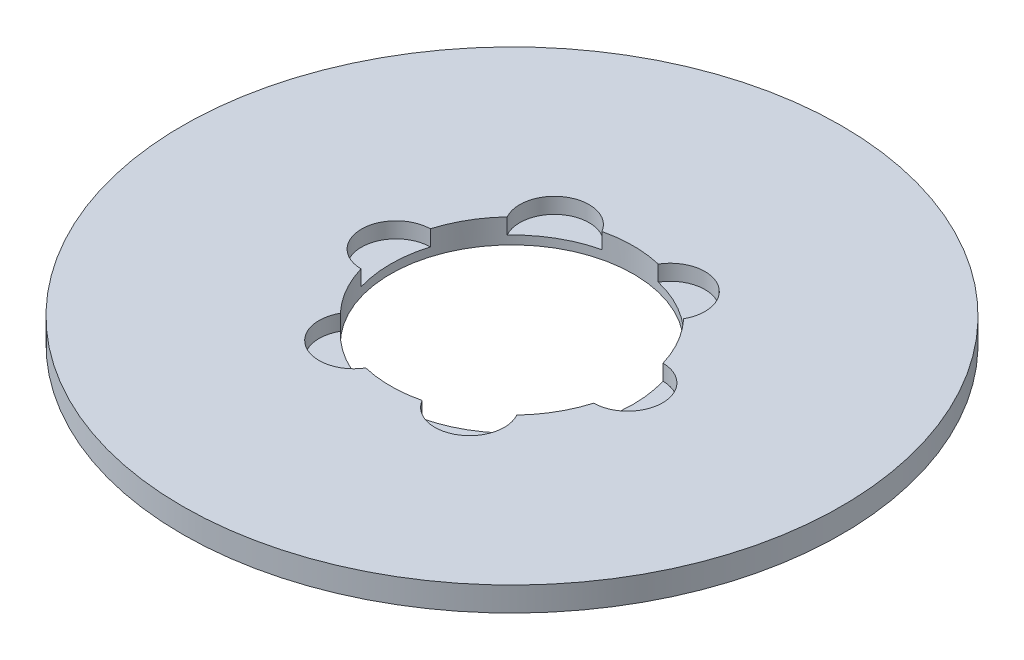
ISO-10303-21;
HEADER;
FILE_DESCRIPTION(('STEP AP214'),'2;1');
FILE_NAME('part.step','',(''),(''),'','','');
FILE_SCHEMA(('AUTOMOTIVE_DESIGN { 1 0 10303 214 1 1 1 1 }'));
ENDSEC;
DATA;
#1=APPLICATION_CONTEXT('core data for automotive mechanical design processes');
#2=APPLICATION_PROTOCOL_DEFINITION('international standard','automotive_design',2000,#1);
#3=PRODUCT_CONTEXT('',#1,'mechanical');
#4=PRODUCT('Part','Part','',(#3));
#5=PRODUCT_RELATED_PRODUCT_CATEGORY('part','',(#4));
#6=PRODUCT_DEFINITION_FORMATION('','',#4);
#7=PRODUCT_DEFINITION_CONTEXT('part definition',#1,'design');
#8=PRODUCT_DEFINITION('design','',#6,#7);
#9=PRODUCT_DEFINITION_SHAPE('','',#8);
#10=(LENGTH_UNIT() NAMED_UNIT(*) SI_UNIT(.MILLI.,.METRE.));
#11=(NAMED_UNIT(*) PLANE_ANGLE_UNIT() SI_UNIT($,.RADIAN.));
#12=(NAMED_UNIT(*) SI_UNIT($,.STERADIAN.) SOLID_ANGLE_UNIT());
#13=UNCERTAINTY_MEASURE_WITH_UNIT(LENGTH_MEASURE(1.E-05),#10,'distance_accuracy_value','');
#14=(GEOMETRIC_REPRESENTATION_CONTEXT(3) GLOBAL_UNCERTAINTY_ASSIGNED_CONTEXT((#13)) GLOBAL_UNIT_ASSIGNED_CONTEXT((#10,
#11,#12)) REPRESENTATION_CONTEXT('',''));
#15=CARTESIAN_POINT('',(0.,0.,0.));
#16=DIRECTION('',(0.,0.,1.));
#17=DIRECTION('',(1.,0.,0.));
#18=AXIS2_PLACEMENT_3D('',#15,#16,#17);
#19=CARTESIAN_POINT('',(0.,7.,0.));
#20=DIRECTION('',(0.,-1.,0.));
#21=DIRECTION('',(0.,0.,-1.));
#22=AXIS2_PLACEMENT_3D('',#19,#20,#21);
#23=CYLINDRICAL_SURFACE('',#22,95.);
#24=CARTESIAN_POINT('',(0.,7.,0.));
#25=DIRECTION('',(0.,1.,0.));
#26=DIRECTION('',(0.,0.,1.));
#27=AXIS2_PLACEMENT_3D('',#24,#25,#26);
#28=CIRCLE('',#27,95.);
#29=CARTESIAN_POINT('',(0.,7.,95.));
#30=VERTEX_POINT('',#29);
#31=EDGE_CURVE('E162',#30,#30,#28,.T.);
#32=ORIENTED_EDGE('',*,*,#31,.F.);
#33=EDGE_LOOP('',(#32));
#34=FACE_BOUND('',#33,.T.);
#35=CARTESIAN_POINT('',(0.,0.,0.));
#36=DIRECTION('',(0.,1.,0.));
#37=DIRECTION('',(0.,0.,1.));
#38=AXIS2_PLACEMENT_3D('',#35,#36,#37);
#39=CIRCLE('',#38,95.);
#40=CARTESIAN_POINT('',(0.,0.,95.));
#41=VERTEX_POINT('',#40);
#42=EDGE_CURVE('E157',#41,#41,#39,.T.);
#43=ORIENTED_EDGE('',*,*,#42,.T.);
#44=EDGE_LOOP('',(#43));
#45=FACE_BOUND('',#44,.T.);
#46=ADVANCED_FACE('F39',(#34,#45),#23,.T.);
#47=CARTESIAN_POINT('',(0.,7.,0.));
#48=DIRECTION('',(0.,1.,0.));
#49=DIRECTION('',(0.,0.,1.));
#50=AXIS2_PLACEMENT_3D('',#47,#48,#49);
#51=PLANE('',#50);
#52=CARTESIAN_POINT('',(-16.7018368050694,7.,-28.9284299261033));
#53=DIRECTION('',(0.,1.,0.));
#54=DIRECTION('',(-0.866025403784433,0.,0.50000000000001));
#55=AXIS2_PLACEMENT_3D('',#52,#53,#54);
#56=CIRCLE('',#55,10.);
#57=CARTESIAN_POINT('',(-8.11121720836771,7.,-34.0471460683371));
#58=VERTEX_POINT('',#57);
#59=CARTESIAN_POINT('',(-25.4300848173561,7.,-24.0480931922279));
#60=VERTEX_POINT('',#59);
#61=EDGE_CURVE('E218',#58,#60,#56,.T.);
#62=ORIENTED_EDGE('',*,*,#61,.F.);
#63=CARTESIAN_POINT('',(0.,7.,0.));
#64=DIRECTION('',(0.,1.,0.));
#65=DIRECTION('',(0.,0.,1.));
#66=AXIS2_PLACEMENT_3D('',#63,#64,#65);
#67=CIRCLE('',#66,35.);
#68=CARTESIAN_POINT('',(8.11121720836699,7.,-34.0471460683372));
#69=VERTEX_POINT('',#68);
#70=EDGE_CURVE('E169',#69,#58,#67,.T.);
#71=ORIENTED_EDGE('',*,*,#70,.F.);
#72=CARTESIAN_POINT('',(16.7018368050688,7.,-28.9284299261037));
#73=DIRECTION('',(0.,1.,0.));
#74=DIRECTION('',(-0.866025403784443,0.,-0.499999999999992));
#75=AXIS2_PLACEMENT_3D('',#72,#73,#74);
#76=CIRCLE('',#75,10.);
#77=CARTESIAN_POINT('',(25.4300848173556,7.,-24.0480931922284));
#78=VERTEX_POINT('',#77);
#79=EDGE_CURVE('E285',#78,#69,#76,.T.);
#80=ORIENTED_EDGE('',*,*,#79,.F.);
#81=CARTESIAN_POINT('',(33.5413020257231,7.,-9.999052876109));
#82=VERTEX_POINT('',#81);
#83=EDGE_CURVE('E174',#82,#78,#67,.T.);
#84=ORIENTED_EDGE('',*,*,#83,.F.);
#85=CARTESIAN_POINT('',(33.4036736101382,7.,0.));
#86=DIRECTION('',(0.,1.,0.));
#87=DIRECTION('',(0.,0.,-1.));
#88=AXIS2_PLACEMENT_3D('',#85,#86,#87);
#89=CIRCLE('',#88,10.);
#90=CARTESIAN_POINT('',(33.5413020257231,7.,9.999052876109));
#91=VERTEX_POINT('',#90);
#92=EDGE_CURVE('E280',#91,#82,#89,.T.);
#93=ORIENTED_EDGE('',*,*,#92,.F.);
#94=CARTESIAN_POINT('',(25.4300848173559,7.,24.048093192228));
#95=VERTEX_POINT('',#94);
#96=EDGE_CURVE('E164',#95,#91,#67,.T.);
#97=ORIENTED_EDGE('',*,*,#96,.F.);
#98=CARTESIAN_POINT('',(16.7018368050692,7.,28.9284299261034));
#99=DIRECTION('',(0.,1.,0.));
#100=DIRECTION('',(0.866025403784436,0.,-0.500000000000004));
#101=AXIS2_PLACEMENT_3D('',#98,#99,#100);
#102=CIRCLE('',#101,10.);
#103=CARTESIAN_POINT('',(8.11121720836747,7.,34.0471460683371));
#104=VERTEX_POINT('',#103);
#105=EDGE_CURVE('E269',#104,#95,#102,.T.);
#106=ORIENTED_EDGE('',*,*,#105,.F.);
#107=CARTESIAN_POINT('',(-8.11121720836723,7.,34.0471460683372));
#108=VERTEX_POINT('',#107);
#109=EDGE_CURVE('E149',#108,#104,#67,.T.);
#110=ORIENTED_EDGE('',*,*,#109,.F.);
#111=CARTESIAN_POINT('',(-16.701836805069,7.,28.9284299261035));
#112=DIRECTION('',(0.,1.,0.));
#113=DIRECTION('',(0.86602540378444,0.,0.499999999999998));
#114=AXIS2_PLACEMENT_3D('',#111,#112,#113);
#115=CIRCLE('',#114,10.);
#116=CARTESIAN_POINT('',(-25.4300848173557,7.,24.0480931922282));
#117=VERTEX_POINT('',#116);
#118=EDGE_CURVE('E128',#117,#108,#115,.T.);
#119=ORIENTED_EDGE('',*,*,#118,.F.);
#120=CARTESIAN_POINT('',(-33.5413020257231,7.,9.999052876109));
#121=VERTEX_POINT('',#120);
#122=EDGE_CURVE('E148',#121,#117,#67,.T.);
#123=ORIENTED_EDGE('',*,*,#122,.F.);
#124=CARTESIAN_POINT('',(-33.4036736101382,7.,0.));
#125=DIRECTION('',(0.,1.,0.));
#126=DIRECTION('',(0.,0.,1.));
#127=AXIS2_PLACEMENT_3D('',#124,#125,#126);
#128=CIRCLE('',#127,10.);
#129=CARTESIAN_POINT('',(-33.5413020257231,7.,-9.999052876109));
#130=VERTEX_POINT('',#129);
#131=EDGE_CURVE('E179',#130,#121,#128,.T.);
#132=ORIENTED_EDGE('',*,*,#131,.F.);
#133=EDGE_CURVE('E161',#60,#130,#67,.T.);
#134=ORIENTED_EDGE('',*,*,#133,.F.);
#135=EDGE_LOOP('',(#62,#71,#80,#84,#93,#97,#106,#110,#119,#123,#132,#134));
#136=FACE_BOUND('',#135,.T.);
#137=ORIENTED_EDGE('',*,*,#31,.T.);
#138=EDGE_LOOP('',(#137));
#139=FACE_BOUND('',#138,.T.);
#140=ADVANCED_FACE('F141',(#136,#139),#51,.T.);
#141=CARTESIAN_POINT('',(0.,0.,0.));
#142=DIRECTION('',(0.,1.,0.));
#143=DIRECTION('',(0.,0.,1.));
#144=AXIS2_PLACEMENT_3D('',#141,#142,#143);
#145=PLANE('',#144);
#146=CARTESIAN_POINT('',(0.,0.,0.));
#147=DIRECTION('',(0.,1.,0.));
#148=DIRECTION('',(0.,0.,1.));
#149=AXIS2_PLACEMENT_3D('',#146,#147,#148);
#150=CIRCLE('',#149,35.);
#151=CARTESIAN_POINT('',(0.,0.,35.));
#152=VERTEX_POINT('',#151);
#153=EDGE_CURVE('E166',#152,#152,#150,.T.);
#154=ORIENTED_EDGE('',*,*,#153,.T.);
#155=EDGE_LOOP('',(#154));
#156=FACE_BOUND('',#155,.T.);
#157=ORIENTED_EDGE('',*,*,#42,.F.);
#158=EDGE_LOOP('',(#157));
#159=FACE_BOUND('',#158,.T.);
#160=ADVANCED_FACE('F234',(#156,#159),#145,.F.);
#161=CARTESIAN_POINT('',(0.,7.,0.));
#162=DIRECTION('',(0.,-1.,0.));
#163=DIRECTION('',(0.,0.,-1.));
#164=AXIS2_PLACEMENT_3D('',#161,#162,#163);
#165=CYLINDRICAL_SURFACE('',#164,35.);
#166=DIRECTION('',(0.,1.,0.));
#167=VECTOR('',#166,1.);
#168=CARTESIAN_POINT('',(-8.11121720836771,4.74056565783408,-34.0471460683371));
#169=LINE('',#168,#167);
#170=CARTESIAN_POINT('',(-8.11121720836771,2.48113131566816,-34.0471460683371));
#171=VERTEX_POINT('',#170);
#172=EDGE_CURVE('E11',#171,#58,#169,.T.);
#173=ORIENTED_EDGE('',*,*,#172,.F.);
#174=CARTESIAN_POINT('',(0.,2.48113131566816,0.));
#175=DIRECTION('',(0.,1.,0.));
#176=DIRECTION('',(0.,0.,1.));
#177=AXIS2_PLACEMENT_3D('',#174,#175,#176);
#178=CIRCLE('',#177,35.);
#179=CARTESIAN_POINT('',(-25.4300848173561,2.48113131566816,-24.0480931922279));
#180=VERTEX_POINT('',#179);
#181=EDGE_CURVE('E214',#171,#180,#178,.T.);
#182=ORIENTED_EDGE('',*,*,#181,.T.);
#183=DIRECTION('',(0.,1.,0.));
#184=VECTOR('',#183,1.);
#185=CARTESIAN_POINT('',(-25.4300848173561,4.74056565783408,-24.0480931922279));
#186=LINE('',#185,#184);
#187=EDGE_CURVE('E46',#60,#180,#186,.F.);
#188=ORIENTED_EDGE('',*,*,#187,.F.);
#189=ORIENTED_EDGE('',*,*,#133,.T.);
#190=DIRECTION('',(0.,1.,0.));
#191=VECTOR('',#190,1.);
#192=CARTESIAN_POINT('',(-33.5413020257231,4.74056565783408,-9.999052876109));
#193=LINE('',#192,#191);
#194=CARTESIAN_POINT('',(-33.5413020257231,2.48113131566816,-9.999052876109));
#195=VERTEX_POINT('',#194);
#196=EDGE_CURVE('E187',#195,#130,#193,.T.);
#197=ORIENTED_EDGE('',*,*,#196,.F.);
#198=CARTESIAN_POINT('',(0.,2.48113131566816,0.));
#199=DIRECTION('',(0.,1.,0.));
#200=DIRECTION('',(0.,0.,1.));
#201=AXIS2_PLACEMENT_3D('',#198,#199,#200);
#202=CIRCLE('',#201,35.);
#203=CARTESIAN_POINT('',(-33.5413020257231,2.48113131566816,9.999052876109));
#204=VERTEX_POINT('',#203);
#205=EDGE_CURVE('E184',#195,#204,#202,.T.);
#206=ORIENTED_EDGE('',*,*,#205,.T.);
#207=DIRECTION('',(0.,1.,0.));
#208=VECTOR('',#207,1.);
#209=CARTESIAN_POINT('',(-33.5413020257231,4.74056565783408,9.999052876109));
#210=LINE('',#209,#208);
#211=EDGE_CURVE('E158',#121,#204,#210,.F.);
#212=ORIENTED_EDGE('',*,*,#211,.F.);
#213=ORIENTED_EDGE('',*,*,#122,.T.);
#214=DIRECTION('',(0.,1.,0.));
#215=VECTOR('',#214,1.);
#216=CARTESIAN_POINT('',(-25.4300848173557,4.74056565783408,24.0480931922282));
#217=LINE('',#216,#215);
#218=CARTESIAN_POINT('',(-25.4300848173557,2.48113131566816,24.0480931922282));
#219=VERTEX_POINT('',#218);
#220=EDGE_CURVE('E127',#219,#117,#217,.T.);
#221=ORIENTED_EDGE('',*,*,#220,.F.);
#222=CARTESIAN_POINT('',(0.,2.48113131566816,0.));
#223=DIRECTION('',(0.,1.,0.));
#224=DIRECTION('',(0.,0.,1.));
#225=AXIS2_PLACEMENT_3D('',#222,#223,#224);
#226=CIRCLE('',#225,35.);
#227=CARTESIAN_POINT('',(-8.11121720836723,2.48113131566816,34.0471460683372));
#228=VERTEX_POINT('',#227);
#229=EDGE_CURVE('E189',#219,#228,#226,.T.);
#230=ORIENTED_EDGE('',*,*,#229,.T.);
#231=DIRECTION('',(0.,1.,0.));
#232=VECTOR('',#231,1.);
#233=CARTESIAN_POINT('',(-8.11121720836723,4.74056565783408,34.0471460683372));
#234=LINE('',#233,#232);
#235=EDGE_CURVE('E140',#108,#228,#234,.F.);
#236=ORIENTED_EDGE('',*,*,#235,.F.);
#237=ORIENTED_EDGE('',*,*,#109,.T.);
#238=DIRECTION('',(0.,1.,0.));
#239=VECTOR('',#238,1.);
#240=CARTESIAN_POINT('',(8.11121720836747,4.74056565783408,34.0471460683371));
#241=LINE('',#240,#239);
#242=CARTESIAN_POINT('',(8.11121720836747,2.48113131566816,34.0471460683371));
#243=VERTEX_POINT('',#242);
#244=EDGE_CURVE('E196',#243,#104,#241,.T.);
#245=ORIENTED_EDGE('',*,*,#244,.F.);
#246=CARTESIAN_POINT('',(0.,2.48113131566816,0.));
#247=DIRECTION('',(0.,1.,0.));
#248=DIRECTION('',(0.,0.,1.));
#249=AXIS2_PLACEMENT_3D('',#246,#247,#248);
#250=CIRCLE('',#249,35.);
#251=CARTESIAN_POINT('',(25.4300848173559,2.48113131566816,24.048093192228));
#252=VERTEX_POINT('',#251);
#253=EDGE_CURVE('E136',#243,#252,#250,.T.);
#254=ORIENTED_EDGE('',*,*,#253,.T.);
#255=DIRECTION('',(0.,1.,0.));
#256=VECTOR('',#255,1.);
#257=CARTESIAN_POINT('',(25.4300848173559,4.74056565783408,24.0480931922281));
#258=LINE('',#257,#256);
#259=EDGE_CURVE('E194',#95,#252,#258,.F.);
#260=ORIENTED_EDGE('',*,*,#259,.F.);
#261=ORIENTED_EDGE('',*,*,#96,.T.);
#262=DIRECTION('',(0.,1.,0.));
#263=VECTOR('',#262,1.);
#264=CARTESIAN_POINT('',(33.5413020257231,4.74056565783408,9.999052876109));
#265=LINE('',#264,#263);
#266=CARTESIAN_POINT('',(33.5413020257231,2.48113131566816,9.999052876109));
#267=VERTEX_POINT('',#266);
#268=EDGE_CURVE('E206',#267,#91,#265,.T.);
#269=ORIENTED_EDGE('',*,*,#268,.F.);
#270=CARTESIAN_POINT('',(0.,2.48113131566816,0.));
#271=DIRECTION('',(0.,1.,0.));
#272=DIRECTION('',(0.,0.,1.));
#273=AXIS2_PLACEMENT_3D('',#270,#271,#272);
#274=CIRCLE('',#273,35.);
#275=CARTESIAN_POINT('',(33.5413020257231,2.48113131566816,-9.999052876109));
#276=VERTEX_POINT('',#275);
#277=EDGE_CURVE('E199',#267,#276,#274,.T.);
#278=ORIENTED_EDGE('',*,*,#277,.T.);
#279=DIRECTION('',(0.,1.,0.));
#280=VECTOR('',#279,1.);
#281=CARTESIAN_POINT('',(33.5413020257231,4.74056565783408,-9.999052876109));
#282=LINE('',#281,#280);
#283=EDGE_CURVE('E201',#82,#276,#282,.F.);
#284=ORIENTED_EDGE('',*,*,#283,.F.);
#285=ORIENTED_EDGE('',*,*,#83,.T.);
#286=DIRECTION('',(0.,1.,0.));
#287=VECTOR('',#286,1.);
#288=CARTESIAN_POINT('',(25.4300848173556,4.74056565783408,-24.0480931922284));
#289=LINE('',#288,#287);
#290=CARTESIAN_POINT('',(25.4300848173556,2.48113131566816,-24.0480931922284));
#291=VERTEX_POINT('',#290);
#292=EDGE_CURVE('E213',#291,#78,#289,.T.);
#293=ORIENTED_EDGE('',*,*,#292,.F.);
#294=CARTESIAN_POINT('',(0.,2.48113131566816,0.));
#295=DIRECTION('',(0.,1.,0.));
#296=DIRECTION('',(0.,0.,1.));
#297=AXIS2_PLACEMENT_3D('',#294,#295,#296);
#298=CIRCLE('',#297,35.);
#299=CARTESIAN_POINT('',(8.11121720836699,2.48113131566816,-34.0471460683372));
#300=VERTEX_POINT('',#299);
#301=EDGE_CURVE('E208',#291,#300,#298,.T.);
#302=ORIENTED_EDGE('',*,*,#301,.T.);
#303=DIRECTION('',(0.,1.,0.));
#304=VECTOR('',#303,1.);
#305=CARTESIAN_POINT('',(8.111217208367,4.74056565783408,-34.0471460683372));
#306=LINE('',#305,#304);
#307=EDGE_CURVE('E211',#69,#300,#306,.F.);
#308=ORIENTED_EDGE('',*,*,#307,.F.);
#309=ORIENTED_EDGE('',*,*,#70,.T.);
#310=EDGE_LOOP('',(#173,#182,#188,#189,#197,#206,#212,#213,#221,#230,#236,#237,#245,#254,#260,
#261,#269,#278,#284,#285,#293,#302,#308,#309));
#311=FACE_BOUND('',#310,.T.);
#312=ORIENTED_EDGE('',*,*,#153,.F.);
#313=EDGE_LOOP('',(#312));
#314=FACE_BOUND('',#313,.T.);
#315=ADVANCED_FACE('F152',(#311,#314),#165,.F.);
#316=CARTESIAN_POINT('',(-33.4036736101382,2.48113131566816,0.));
#317=DIRECTION('',(0.,1.,0.));
#318=DIRECTION('',(0.,0.,1.));
#319=AXIS2_PLACEMENT_3D('',#316,#317,#318);
#320=CYLINDRICAL_SURFACE('',#319,10.);
#321=ORIENTED_EDGE('',*,*,#196,.T.);
#322=ORIENTED_EDGE('',*,*,#131,.T.);
#323=ORIENTED_EDGE('',*,*,#211,.T.);
#324=CARTESIAN_POINT('',(-33.4036736101382,2.48113131566816,0.));
#325=DIRECTION('',(0.,1.,0.));
#326=DIRECTION('',(0.,0.,1.));
#327=AXIS2_PLACEMENT_3D('',#324,#325,#326);
#328=CIRCLE('',#327,10.);
#329=EDGE_CURVE('E180',#195,#204,#328,.T.);
#330=ORIENTED_EDGE('',*,*,#329,.F.);
#331=EDGE_LOOP('',(#321,#322,#323,#330));
#332=FACE_BOUND('',#331,.T.);
#333=ADVANCED_FACE('F244',(#332),#320,.F.);
#334=CARTESIAN_POINT('',(-33.4036736101382,2.48113131566816,0.));
#335=DIRECTION('',(0.,1.,0.));
#336=DIRECTION('',(0.,0.,1.));
#337=AXIS2_PLACEMENT_3D('',#334,#335,#336);
#338=PLANE('',#337);
#339=ORIENTED_EDGE('',*,*,#329,.T.);
#340=ORIENTED_EDGE('',*,*,#205,.F.);
#341=EDGE_LOOP('',(#339,#340));
#342=FACE_BOUND('',#341,.T.);
#343=ADVANCED_FACE('F248',(#342),#338,.T.);
#344=CARTESIAN_POINT('',(-16.701836805069,2.48113131566816,28.9284299261035));
#345=DIRECTION('',(0.,1.,0.));
#346=DIRECTION('',(0.,0.,1.));
#347=AXIS2_PLACEMENT_3D('',#344,#345,#346);
#348=CYLINDRICAL_SURFACE('',#347,10.);
#349=ORIENTED_EDGE('',*,*,#220,.T.);
#350=ORIENTED_EDGE('',*,*,#118,.T.);
#351=ORIENTED_EDGE('',*,*,#235,.T.);
#352=CARTESIAN_POINT('',(-16.701836805069,2.48113131566816,28.9284299261035));
#353=DIRECTION('',(0.,1.,0.));
#354=DIRECTION('',(0.86602540378444,0.,0.499999999999998));
#355=AXIS2_PLACEMENT_3D('',#352,#353,#354);
#356=CIRCLE('',#355,10.);
#357=EDGE_CURVE('E135',#219,#228,#356,.T.);
#358=ORIENTED_EDGE('',*,*,#357,.F.);
#359=EDGE_LOOP('',(#349,#350,#351,#358));
#360=FACE_BOUND('',#359,.T.);
#361=ADVANCED_FACE('F126',(#360),#348,.F.);
#362=CARTESIAN_POINT('',(-16.701836805069,2.48113131566816,28.9284299261035));
#363=DIRECTION('',(0.,1.,0.));
#364=DIRECTION('',(0.86602540378444,0.,0.499999999999998));
#365=AXIS2_PLACEMENT_3D('',#362,#363,#364);
#366=PLANE('',#365);
#367=ORIENTED_EDGE('',*,*,#357,.T.);
#368=ORIENTED_EDGE('',*,*,#229,.F.);
#369=EDGE_LOOP('',(#367,#368));
#370=FACE_BOUND('',#369,.T.);
#371=ADVANCED_FACE('F258',(#370),#366,.T.);
#372=CARTESIAN_POINT('',(16.7018368050692,2.48113131566816,28.9284299261034));
#373=DIRECTION('',(0.,1.,0.));
#374=DIRECTION('',(0.,0.,1.));
#375=AXIS2_PLACEMENT_3D('',#372,#373,#374);
#376=CYLINDRICAL_SURFACE('',#375,10.);
#377=ORIENTED_EDGE('',*,*,#244,.T.);
#378=ORIENTED_EDGE('',*,*,#105,.T.);
#379=ORIENTED_EDGE('',*,*,#259,.T.);
#380=CARTESIAN_POINT('',(16.7018368050692,2.48113131566816,28.9284299261034));
#381=DIRECTION('',(0.,1.,0.));
#382=DIRECTION('',(0.866025403784436,0.,-0.500000000000004));
#383=AXIS2_PLACEMENT_3D('',#380,#381,#382);
#384=CIRCLE('',#383,10.);
#385=EDGE_CURVE('E147',#243,#252,#384,.T.);
#386=ORIENTED_EDGE('',*,*,#385,.F.);
#387=EDGE_LOOP('',(#377,#378,#379,#386));
#388=FACE_BOUND('',#387,.T.);
#389=ADVANCED_FACE('F256',(#388),#376,.F.);
#390=CARTESIAN_POINT('',(16.7018368050692,2.48113131566816,28.9284299261034));
#391=DIRECTION('',(0.,1.,0.));
#392=DIRECTION('',(0.866025403784436,0.,-0.500000000000004));
#393=AXIS2_PLACEMENT_3D('',#390,#391,#392);
#394=PLANE('',#393);
#395=ORIENTED_EDGE('',*,*,#385,.T.);
#396=ORIENTED_EDGE('',*,*,#253,.F.);
#397=EDGE_LOOP('',(#395,#396));
#398=FACE_BOUND('',#397,.T.);
#399=ADVANCED_FACE('F263',(#398),#394,.T.);
#400=CARTESIAN_POINT('',(33.4036736101382,2.48113131566816,0.));
#401=DIRECTION('',(0.,1.,0.));
#402=DIRECTION('',(0.,0.,1.));
#403=AXIS2_PLACEMENT_3D('',#400,#401,#402);
#404=CYLINDRICAL_SURFACE('',#403,10.);
#405=ORIENTED_EDGE('',*,*,#268,.T.);
#406=ORIENTED_EDGE('',*,*,#92,.T.);
#407=ORIENTED_EDGE('',*,*,#283,.T.);
#408=CARTESIAN_POINT('',(33.4036736101382,2.48113131566816,0.));
#409=DIRECTION('',(0.,1.,0.));
#410=DIRECTION('',(0.,0.,-1.));
#411=AXIS2_PLACEMENT_3D('',#408,#409,#410);
#412=CIRCLE('',#411,10.);
#413=EDGE_CURVE('E273',#267,#276,#412,.T.);
#414=ORIENTED_EDGE('',*,*,#413,.F.);
#415=EDGE_LOOP('',(#405,#406,#407,#414));
#416=FACE_BOUND('',#415,.T.);
#417=ADVANCED_FACE('F297',(#416),#404,.F.);
#418=CARTESIAN_POINT('',(33.4036736101382,2.48113131566816,0.));
#419=DIRECTION('',(0.,1.,0.));
#420=DIRECTION('',(0.,0.,-1.));
#421=AXIS2_PLACEMENT_3D('',#418,#419,#420);
#422=PLANE('',#421);
#423=ORIENTED_EDGE('',*,*,#413,.T.);
#424=ORIENTED_EDGE('',*,*,#277,.F.);
#425=EDGE_LOOP('',(#423,#424));
#426=FACE_BOUND('',#425,.T.);
#427=ADVANCED_FACE('F299',(#426),#422,.T.);
#428=CARTESIAN_POINT('',(16.7018368050688,2.48113131566816,-28.9284299261037));
#429=DIRECTION('',(0.,1.,0.));
#430=DIRECTION('',(0.,0.,1.));
#431=AXIS2_PLACEMENT_3D('',#428,#429,#430);
#432=CYLINDRICAL_SURFACE('',#431,10.);
#433=ORIENTED_EDGE('',*,*,#292,.T.);
#434=ORIENTED_EDGE('',*,*,#79,.T.);
#435=ORIENTED_EDGE('',*,*,#307,.T.);
#436=CARTESIAN_POINT('',(16.7018368050688,2.48113131566816,-28.9284299261037));
#437=DIRECTION('',(0.,1.,0.));
#438=DIRECTION('',(-0.866025403784443,0.,-0.499999999999992));
#439=AXIS2_PLACEMENT_3D('',#436,#437,#438);
#440=CIRCLE('',#439,10.);
#441=EDGE_CURVE('E56',#291,#300,#440,.T.);
#442=ORIENTED_EDGE('',*,*,#441,.F.);
#443=EDGE_LOOP('',(#433,#434,#435,#442));
#444=FACE_BOUND('',#443,.T.);
#445=ADVANCED_FACE('F292',(#444),#432,.F.);
#446=CARTESIAN_POINT('',(16.7018368050688,2.48113131566816,-28.9284299261037));
#447=DIRECTION('',(0.,1.,0.));
#448=DIRECTION('',(-0.866025403784443,0.,-0.499999999999992));
#449=AXIS2_PLACEMENT_3D('',#446,#447,#448);
#450=PLANE('',#449);
#451=ORIENTED_EDGE('',*,*,#441,.T.);
#452=ORIENTED_EDGE('',*,*,#301,.F.);
#453=EDGE_LOOP('',(#451,#452));
#454=FACE_BOUND('',#453,.T.);
#455=ADVANCED_FACE('F226',(#454),#450,.T.);
#456=CARTESIAN_POINT('',(-16.7018368050694,2.48113131566816,-28.9284299261033));
#457=DIRECTION('',(0.,1.,0.));
#458=DIRECTION('',(0.,0.,1.));
#459=AXIS2_PLACEMENT_3D('',#456,#457,#458);
#460=CYLINDRICAL_SURFACE('',#459,10.);
#461=ORIENTED_EDGE('',*,*,#172,.T.);
#462=ORIENTED_EDGE('',*,*,#61,.T.);
#463=ORIENTED_EDGE('',*,*,#187,.T.);
#464=CARTESIAN_POINT('',(-16.7018368050694,2.48113131566816,-28.9284299261033));
#465=DIRECTION('',(0.,1.,0.));
#466=DIRECTION('',(-0.866025403784433,0.,0.50000000000001));
#467=AXIS2_PLACEMENT_3D('',#464,#465,#466);
#468=CIRCLE('',#467,10.);
#469=EDGE_CURVE('E55',#171,#180,#468,.T.);
#470=ORIENTED_EDGE('',*,*,#469,.F.);
#471=EDGE_LOOP('',(#461,#462,#463,#470));
#472=FACE_BOUND('',#471,.T.);
#473=ADVANCED_FACE('F217',(#472),#460,.F.);
#474=CARTESIAN_POINT('',(-16.7018368050694,2.48113131566816,-28.9284299261033));
#475=DIRECTION('',(0.,1.,0.));
#476=DIRECTION('',(-0.866025403784433,0.,0.50000000000001));
#477=AXIS2_PLACEMENT_3D('',#474,#475,#476);
#478=PLANE('',#477);
#479=ORIENTED_EDGE('',*,*,#469,.T.);
#480=ORIENTED_EDGE('',*,*,#181,.F.);
#481=EDGE_LOOP('',(#479,#480));
#482=FACE_BOUND('',#481,.T.);
#483=ADVANCED_FACE('F219',(#482),#478,.T.);
#484=CLOSED_SHELL('',(#46,#140,#160,#315,#333,#343,#361,#371,#389,#399,#417,#427,#445,#455,#473,#483));
#485=MANIFOLD_SOLID_BREP('B2',#484);
#486=ADVANCED_BREP_SHAPE_REPRESENTATION('',(#18,#485),#14);
#487=SHAPE_DEFINITION_REPRESENTATION(#9,#486);
ENDSEC;
END-ISO-10303-21;
